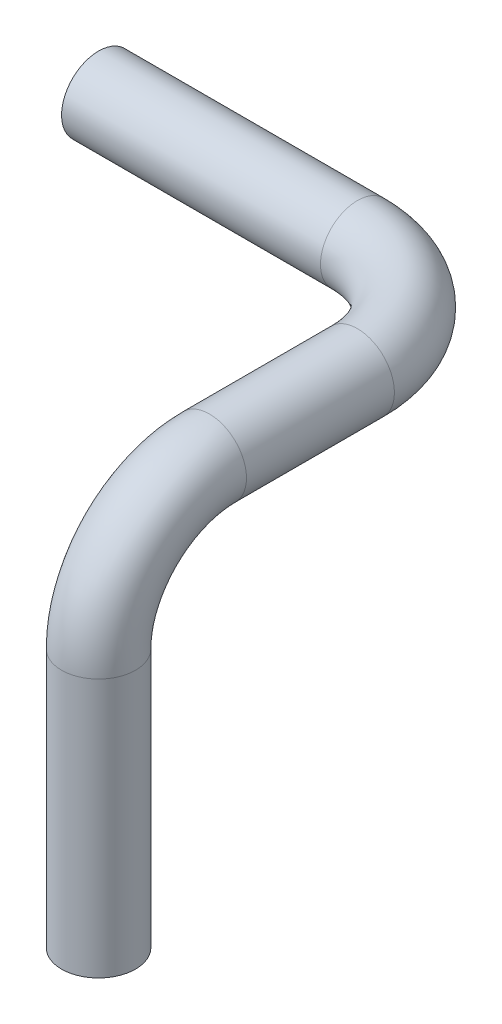
ISO-10303-21;
HEADER;
FILE_DESCRIPTION(('STEP AP214'),'2;1');
FILE_NAME('part.step','',(''),(''),'','','');
FILE_SCHEMA(('AUTOMOTIVE_DESIGN { 1 0 10303 214 1 1 1 1 }'));
ENDSEC;
DATA;
#1=APPLICATION_CONTEXT('core data for automotive mechanical design processes');
#2=APPLICATION_PROTOCOL_DEFINITION('international standard','automotive_design',2000,#1);
#3=PRODUCT_CONTEXT('',#1,'mechanical');
#4=PRODUCT('Part','Part','',(#3));
#5=PRODUCT_RELATED_PRODUCT_CATEGORY('part','',(#4));
#6=PRODUCT_DEFINITION_FORMATION('','',#4);
#7=PRODUCT_DEFINITION_CONTEXT('part definition',#1,'design');
#8=PRODUCT_DEFINITION('design','',#6,#7);
#9=PRODUCT_DEFINITION_SHAPE('','',#8);
#10=(LENGTH_UNIT() NAMED_UNIT(*) SI_UNIT(.MILLI.,.METRE.));
#11=(NAMED_UNIT(*) PLANE_ANGLE_UNIT() SI_UNIT($,.RADIAN.));
#12=(NAMED_UNIT(*) SI_UNIT($,.STERADIAN.) SOLID_ANGLE_UNIT());
#13=UNCERTAINTY_MEASURE_WITH_UNIT(LENGTH_MEASURE(1.E-05),#10,'distance_accuracy_value','');
#14=(GEOMETRIC_REPRESENTATION_CONTEXT(3) GLOBAL_UNCERTAINTY_ASSIGNED_CONTEXT((#13)) GLOBAL_UNIT_ASSIGNED_CONTEXT((#10,
#11,#12)) REPRESENTATION_CONTEXT('',''));
#15=CARTESIAN_POINT('',(0.,0.,0.));
#16=DIRECTION('',(0.,0.,1.));
#17=DIRECTION('',(1.,0.,0.));
#18=AXIS2_PLACEMENT_3D('',#15,#16,#17);
#19=CARTESIAN_POINT('',(0.,254.,5.6843418860808E-11));
#20=DIRECTION('',(-1.,0.,0.));
#21=DIRECTION('',(0.,1.,0.));
#22=AXIS2_PLACEMENT_3D('',#19,#20,#21);
#23=PLANE('',#22);
#24=CARTESIAN_POINT('',(0.,254.,5.6843418860808E-11));
#25=DIRECTION('',(-1.,0.,0.));
#26=DIRECTION('',(0.,0.,1.));
#27=AXIS2_PLACEMENT_3D('',#24,#25,#26);
#28=CIRCLE('',#27,22.86);
#29=CARTESIAN_POINT('',(0.,254.,22.8600000000568));
#30=VERTEX_POINT('',#29);
#31=EDGE_CURVE('E85',#30,#30,#28,.T.);
#32=ORIENTED_EDGE('',*,*,#31,.F.);
#33=EDGE_LOOP('',(#32));
#34=FACE_BOUND('',#33,.T.);
#35=CARTESIAN_POINT('',(0.,254.,5.6843418860808E-11));
#36=DIRECTION('',(-1.,0.,0.));
#37=DIRECTION('',(0.,1.,0.));
#38=AXIS2_PLACEMENT_3D('',#35,#36,#37);
#39=CIRCLE('',#38,25.4);
#40=CARTESIAN_POINT('',(0.,279.4,5.6843418860808E-11));
#41=VERTEX_POINT('',#40);
#42=EDGE_CURVE('E76',#41,#41,#39,.T.);
#43=ORIENTED_EDGE('',*,*,#42,.T.);
#44=EDGE_LOOP('',(#43));
#45=FACE_BOUND('',#44,.T.);
#46=ADVANCED_FACE('F49',(#34,#45),#23,.T.);
#47=CARTESIAN_POINT('',(254.,0.,254.));
#48=DIRECTION('',(0.,1.,0.));
#49=DIRECTION('',(0.,0.,1.));
#50=AXIS2_PLACEMENT_3D('',#47,#48,#49);
#51=PLANE('',#50);
#52=CARTESIAN_POINT('',(254.,0.,254.));
#53=DIRECTION('',(0.,1.,0.));
#54=DIRECTION('',(0.,0.,1.));
#55=AXIS2_PLACEMENT_3D('',#52,#53,#54);
#56=CIRCLE('',#55,22.86);
#57=CARTESIAN_POINT('',(254.,0.,276.86));
#58=VERTEX_POINT('',#57);
#59=EDGE_CURVE('E80',#58,#58,#56,.T.);
#60=ORIENTED_EDGE('',*,*,#59,.T.);
#61=EDGE_LOOP('',(#60));
#62=FACE_BOUND('',#61,.T.);
#63=CARTESIAN_POINT('',(254.,0.,254.));
#64=DIRECTION('',(0.,1.,0.));
#65=DIRECTION('',(0.,0.,1.));
#66=AXIS2_PLACEMENT_3D('',#63,#64,#65);
#67=CIRCLE('',#66,25.4);
#68=CARTESIAN_POINT('',(254.,0.,279.4));
#69=VERTEX_POINT('',#68);
#70=EDGE_CURVE('E11',#69,#69,#67,.T.);
#71=ORIENTED_EDGE('',*,*,#70,.F.);
#72=EDGE_LOOP('',(#71));
#73=FACE_BOUND('',#72,.T.);
#74=ADVANCED_FACE('F116',(#62,#73),#51,.F.);
#75=CARTESIAN_POINT('',(0.,254.,5.6843418860808E-11));
#76=DIRECTION('',(1.,0.,0.));
#77=DIRECTION('',(0.,0.,-1.));
#78=AXIS2_PLACEMENT_3D('',#75,#76,#77);
#79=CYLINDRICAL_SURFACE('',#78,25.4);
#80=CARTESIAN_POINT('',(177.8,254.,5.6843418860808E-11));
#81=DIRECTION('',(-1.,0.,0.));
#82=DIRECTION('',(0.,1.,0.));
#83=AXIS2_PLACEMENT_3D('',#80,#81,#82);
#84=CIRCLE('',#83,25.4);
#85=CARTESIAN_POINT('',(177.8,254.,-25.3999999999431));
#86=VERTEX_POINT('',#85);
#87=EDGE_CURVE('E72',#86,#86,#84,.T.);
#88=ORIENTED_EDGE('',*,*,#87,.T.);
#89=EDGE_LOOP('',(#88));
#90=FACE_BOUND('',#89,.T.);
#91=ORIENTED_EDGE('',*,*,#42,.F.);
#92=EDGE_LOOP('',(#91));
#93=FACE_BOUND('',#92,.T.);
#94=ADVANCED_FACE('F120',(#90,#93),#79,.T.);
#95=CARTESIAN_POINT('',(177.8,254.,76.2000000000569));
#96=DIRECTION('',(0.,-1.,0.));
#97=DIRECTION('',(0.,0.,-1.));
#98=AXIS2_PLACEMENT_3D('',#95,#96,#97);
#99=TOROIDAL_SURFACE('',#98,76.2,25.4);
#100=CARTESIAN_POINT('',(254.,254.,76.2000000000569));
#101=DIRECTION('',(0.,0.,-1.));
#102=DIRECTION('',(0.,1.,0.));
#103=AXIS2_PLACEMENT_3D('',#100,#101,#102);
#104=CIRCLE('',#103,25.4);
#105=CARTESIAN_POINT('',(279.4,254.,76.2000000000569));
#106=VERTEX_POINT('',#105);
#107=EDGE_CURVE('E66',#106,#106,#104,.T.);
#108=CARTESIAN_POINT('',(177.8,254.,76.2000000000569));
#109=DIRECTION('',(0.,-1.,0.));
#110=DIRECTION('',(0.,0.,-1.));
#111=AXIS2_PLACEMENT_3D('',#108,#109,#110);
#112=CIRCLE('',#111,101.6);
#113=EDGE_CURVE('',#86,#106,#112,.T.);
#114=ORIENTED_EDGE('',*,*,#87,.F.);
#115=ORIENTED_EDGE('',*,*,#107,.T.);
#116=ORIENTED_EDGE('',*,*,#113,.T.);
#117=ORIENTED_EDGE('',*,*,#113,.F.);
#118=EDGE_LOOP('',(#114,#116,#115,#117));
#119=FACE_BOUND('',#118,.T.);
#120=ADVANCED_FACE('F122',(#119),#99,.T.);
#121=CARTESIAN_POINT('',(254.,254.,76.2000000000569));
#122=DIRECTION('',(0.,0.,1.));
#123=DIRECTION('',(1.,0.,0.));
#124=AXIS2_PLACEMENT_3D('',#121,#122,#123);
#125=CYLINDRICAL_SURFACE('',#124,25.4);
#126=CARTESIAN_POINT('',(254.,254.,177.8));
#127=DIRECTION('',(0.,0.,-1.));
#128=DIRECTION('',(0.,1.,0.));
#129=AXIS2_PLACEMENT_3D('',#126,#127,#128);
#130=CIRCLE('',#129,25.4);
#131=CARTESIAN_POINT('',(254.,279.4,177.8));
#132=VERTEX_POINT('',#131);
#133=EDGE_CURVE('E61',#132,#132,#130,.T.);
#134=ORIENTED_EDGE('',*,*,#133,.T.);
#135=EDGE_LOOP('',(#134));
#136=FACE_BOUND('',#135,.T.);
#137=ORIENTED_EDGE('',*,*,#107,.F.);
#138=EDGE_LOOP('',(#137));
#139=FACE_BOUND('',#138,.T.);
#140=ADVANCED_FACE('F129',(#136,#139),#125,.T.);
#141=CARTESIAN_POINT('',(254.,177.8,177.8));
#142=DIRECTION('',(1.,0.,0.));
#143=DIRECTION('',(0.,0.,-1.));
#144=AXIS2_PLACEMENT_3D('',#141,#142,#143);
#145=TOROIDAL_SURFACE('',#144,76.2,25.4);
#146=CARTESIAN_POINT('',(254.,177.8,254.));
#147=DIRECTION('',(0.,1.,0.));
#148=DIRECTION('',(0.,0.,1.));
#149=AXIS2_PLACEMENT_3D('',#146,#147,#148);
#150=CIRCLE('',#149,25.4);
#151=CARTESIAN_POINT('',(254.,177.8,279.4));
#152=VERTEX_POINT('',#151);
#153=EDGE_CURVE('E56',#152,#152,#150,.T.);
#154=CARTESIAN_POINT('',(254.,177.8,177.8));
#155=DIRECTION('',(1.,0.,0.));
#156=DIRECTION('',(0.,0.,-1.));
#157=AXIS2_PLACEMENT_3D('',#154,#155,#156);
#158=CIRCLE('',#157,101.6);
#159=EDGE_CURVE('',#132,#152,#158,.T.);
#160=ORIENTED_EDGE('',*,*,#133,.F.);
#161=ORIENTED_EDGE('',*,*,#153,.T.);
#162=ORIENTED_EDGE('',*,*,#159,.T.);
#163=ORIENTED_EDGE('',*,*,#159,.F.);
#164=EDGE_LOOP('',(#160,#162,#161,#163));
#165=FACE_BOUND('',#164,.T.);
#166=ADVANCED_FACE('F135',(#165),#145,.T.);
#167=CARTESIAN_POINT('',(254.,177.8,254.));
#168=DIRECTION('',(0.,-1.,0.));
#169=DIRECTION('',(0.,0.,-1.));
#170=AXIS2_PLACEMENT_3D('',#167,#168,#169);
#171=CYLINDRICAL_SURFACE('',#170,25.4);
#172=ORIENTED_EDGE('',*,*,#70,.T.);
#173=EDGE_LOOP('',(#172));
#174=FACE_BOUND('',#173,.T.);
#175=ORIENTED_EDGE('',*,*,#153,.F.);
#176=EDGE_LOOP('',(#175));
#177=FACE_BOUND('',#176,.T.);
#178=ADVANCED_FACE('F110',(#174,#177),#171,.T.);
#179=CARTESIAN_POINT('',(0.,254.,5.6843418860808E-11));
#180=DIRECTION('',(1.,0.,0.));
#181=DIRECTION('',(0.,0.,-1.));
#182=AXIS2_PLACEMENT_3D('',#179,#180,#181);
#183=CYLINDRICAL_SURFACE('',#182,22.86);
#184=CARTESIAN_POINT('',(177.8,254.,5.6862885710815E-11));
#185=DIRECTION('',(1.,0.,0.));
#186=DIRECTION('',(0.,0.,-1.));
#187=AXIS2_PLACEMENT_3D('',#184,#185,#186);
#188=CIRCLE('',#187,22.86);
#189=CARTESIAN_POINT('',(177.8,254.,-22.8599999999431));
#190=VERTEX_POINT('',#189);
#191=EDGE_CURVE('E89',#190,#190,#188,.F.);
#192=ORIENTED_EDGE('',*,*,#191,.F.);
#193=EDGE_LOOP('',(#192));
#194=FACE_BOUND('',#193,.T.);
#195=ORIENTED_EDGE('',*,*,#31,.T.);
#196=EDGE_LOOP('',(#195));
#197=FACE_BOUND('',#196,.T.);
#198=ADVANCED_FACE('F107',(#194,#197),#183,.F.);
#199=CARTESIAN_POINT('',(177.8,254.,76.2000000000569));
#200=DIRECTION('',(0.,-1.,0.));
#201=DIRECTION('',(0.,0.,-1.));
#202=AXIS2_PLACEMENT_3D('',#199,#200,#201);
#203=TOROIDAL_SURFACE('',#202,76.2,22.86);
#204=CARTESIAN_POINT('',(254.,254.,76.2000000000569));
#205=DIRECTION('',(0.,0.,-1.));
#206=DIRECTION('',(-1.,0.,0.));
#207=AXIS2_PLACEMENT_3D('',#204,#205,#206);
#208=CIRCLE('',#207,22.86);
#209=CARTESIAN_POINT('',(276.86,254.,76.2000000000569));
#210=VERTEX_POINT('',#209);
#211=EDGE_CURVE('E97',#210,#210,#208,.T.);
#212=CARTESIAN_POINT('',(177.8,254.,76.2000000000569));
#213=DIRECTION('',(0.,-1.,0.));
#214=DIRECTION('',(0.,0.,-1.));
#215=AXIS2_PLACEMENT_3D('',#212,#213,#214);
#216=CIRCLE('',#215,99.06);
#217=EDGE_CURVE('',#190,#210,#216,.T.);
#218=ORIENTED_EDGE('',*,*,#191,.T.);
#219=ORIENTED_EDGE('',*,*,#211,.F.);
#220=ORIENTED_EDGE('',*,*,#217,.T.);
#221=ORIENTED_EDGE('',*,*,#217,.F.);
#222=EDGE_LOOP('',(#218,#220,#219,#221));
#223=FACE_BOUND('',#222,.T.);
#224=ADVANCED_FACE('F105',(#223),#203,.F.);
#225=CARTESIAN_POINT('',(254.,254.,76.2000000000569));
#226=DIRECTION('',(0.,0.,1.));
#227=DIRECTION('',(1.,0.,0.));
#228=AXIS2_PLACEMENT_3D('',#225,#226,#227);
#229=CYLINDRICAL_SURFACE('',#228,22.86);
#230=CARTESIAN_POINT('',(254.,254.,177.8));
#231=DIRECTION('',(0.,0.,1.));
#232=DIRECTION('',(1.,0.,0.));
#233=AXIS2_PLACEMENT_3D('',#230,#231,#232);
#234=CIRCLE('',#233,22.86);
#235=CARTESIAN_POINT('',(254.,276.86,177.8));
#236=VERTEX_POINT('',#235);
#237=EDGE_CURVE('E93',#236,#236,#234,.F.);
#238=ORIENTED_EDGE('',*,*,#237,.F.);
#239=EDGE_LOOP('',(#238));
#240=FACE_BOUND('',#239,.T.);
#241=ORIENTED_EDGE('',*,*,#211,.T.);
#242=EDGE_LOOP('',(#241));
#243=FACE_BOUND('',#242,.T.);
#244=ADVANCED_FACE('F191',(#240,#243),#229,.F.);
#245=CARTESIAN_POINT('',(254.,177.8,177.8));
#246=DIRECTION('',(1.,0.,0.));
#247=DIRECTION('',(0.,0.,-1.));
#248=AXIS2_PLACEMENT_3D('',#245,#246,#247);
#249=TOROIDAL_SURFACE('',#248,76.2,22.86);
#250=CARTESIAN_POINT('',(254.,177.8,254.));
#251=DIRECTION('',(0.,1.,0.));
#252=DIRECTION('',(0.,0.,1.));
#253=AXIS2_PLACEMENT_3D('',#250,#251,#252);
#254=CIRCLE('',#253,22.86);
#255=CARTESIAN_POINT('',(254.,177.8,276.86));
#256=VERTEX_POINT('',#255);
#257=EDGE_CURVE('E84',#256,#256,#254,.T.);
#258=CARTESIAN_POINT('',(254.,177.8,177.8));
#259=DIRECTION('',(1.,0.,0.));
#260=DIRECTION('',(0.,0.,-1.));
#261=AXIS2_PLACEMENT_3D('',#258,#259,#260);
#262=CIRCLE('',#261,99.06);
#263=EDGE_CURVE('',#236,#256,#262,.T.);
#264=ORIENTED_EDGE('',*,*,#237,.T.);
#265=ORIENTED_EDGE('',*,*,#257,.F.);
#266=ORIENTED_EDGE('',*,*,#263,.T.);
#267=ORIENTED_EDGE('',*,*,#263,.F.);
#268=EDGE_LOOP('',(#264,#266,#265,#267));
#269=FACE_BOUND('',#268,.T.);
#270=ADVANCED_FACE('F201',(#269),#249,.F.);
#271=CARTESIAN_POINT('',(254.,177.8,254.));
#272=DIRECTION('',(0.,-1.,0.));
#273=DIRECTION('',(0.,0.,-1.));
#274=AXIS2_PLACEMENT_3D('',#271,#272,#273);
#275=CYLINDRICAL_SURFACE('',#274,22.86);
#276=ORIENTED_EDGE('',*,*,#59,.F.);
#277=EDGE_LOOP('',(#276));
#278=FACE_BOUND('',#277,.T.);
#279=ORIENTED_EDGE('',*,*,#257,.T.);
#280=EDGE_LOOP('',(#279));
#281=FACE_BOUND('',#280,.T.);
#282=ADVANCED_FACE('F117',(#278,#281),#275,.F.);
#283=CLOSED_SHELL('',(#46,#74,#94,#120,#140,#166,#178,#198,#224,#244,#270,#282));
#284=MANIFOLD_SOLID_BREP('B2',#283);
#285=ADVANCED_BREP_SHAPE_REPRESENTATION('',(#18,#284),#14);
#286=SHAPE_DEFINITION_REPRESENTATION(#9,#285);
ENDSEC;
END-ISO-10303-21;
